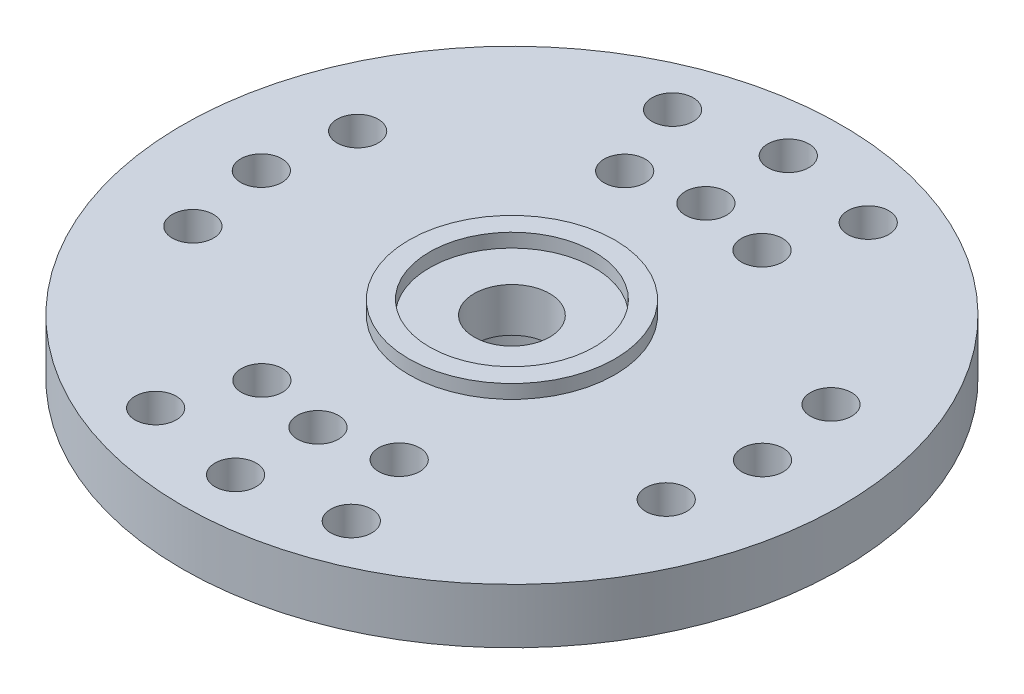
ISO-10303-21;
HEADER;
FILE_DESCRIPTION(('STEP AP214'),'2;1');
FILE_NAME('part.step','',(''),(''),'','','');
FILE_SCHEMA(('AUTOMOTIVE_DESIGN { 1 0 10303 214 1 1 1 1 }'));
ENDSEC;
DATA;
#1=APPLICATION_CONTEXT('core data for automotive mechanical design processes');
#2=APPLICATION_PROTOCOL_DEFINITION('international standard','automotive_design',2000,#1);
#3=PRODUCT_CONTEXT('',#1,'mechanical');
#4=PRODUCT('Part','Part','',(#3));
#5=PRODUCT_RELATED_PRODUCT_CATEGORY('part','',(#4));
#6=PRODUCT_DEFINITION_FORMATION('','',#4);
#7=PRODUCT_DEFINITION_CONTEXT('part definition',#1,'design');
#8=PRODUCT_DEFINITION('design','',#6,#7);
#9=PRODUCT_DEFINITION_SHAPE('','',#8);
#10=(LENGTH_UNIT() NAMED_UNIT(*) SI_UNIT(.MILLI.,.METRE.));
#11=(NAMED_UNIT(*) PLANE_ANGLE_UNIT() SI_UNIT($,.RADIAN.));
#12=(NAMED_UNIT(*) SI_UNIT($,.STERADIAN.) SOLID_ANGLE_UNIT());
#13=UNCERTAINTY_MEASURE_WITH_UNIT(LENGTH_MEASURE(1.E-05),#10,'distance_accuracy_value','');
#14=(GEOMETRIC_REPRESENTATION_CONTEXT(3) GLOBAL_UNCERTAINTY_ASSIGNED_CONTEXT((#13)) GLOBAL_UNIT_ASSIGNED_CONTEXT((#10,
#11,#12)) REPRESENTATION_CONTEXT('',''));
#15=CARTESIAN_POINT('',(0.,0.,0.));
#16=DIRECTION('',(0.,0.,1.));
#17=DIRECTION('',(1.,0.,0.));
#18=AXIS2_PLACEMENT_3D('',#15,#16,#17);
#19=CARTESIAN_POINT('',(0.,0.399999999999998,0.));
#20=DIRECTION('',(0.,1.,0.));
#21=DIRECTION('',(0.,0.,1.));
#22=AXIS2_PLACEMENT_3D('',#19,#20,#21);
#23=PLANE('',#22);
#24=CARTESIAN_POINT('',(0.,0.399999999999998,0.));
#25=DIRECTION('',(0.,1.,0.));
#26=DIRECTION('',(0.,0.,1.));
#27=AXIS2_PLACEMENT_3D('',#24,#25,#26);
#28=CIRCLE('',#27,1.375);
#29=CARTESIAN_POINT('',(0.,0.399999999999998,1.375));
#30=VERTEX_POINT('',#29);
#31=EDGE_CURVE('E25',#30,#30,#28,.T.);
#32=ORIENTED_EDGE('',*,*,#31,.T.);
#33=EDGE_LOOP('',(#32));
#34=FACE_BOUND('',#33,.T.);
#35=CARTESIAN_POINT('',(0.,0.399999999999998,0.));
#36=DIRECTION('',(0.,1.,0.));
#37=DIRECTION('',(0.,0.,1.));
#38=AXIS2_PLACEMENT_3D('',#35,#36,#37);
#39=CIRCLE('',#38,2.85);
#40=CARTESIAN_POINT('',(0.,0.399999999999998,2.85));
#41=VERTEX_POINT('',#40);
#42=EDGE_CURVE('E167',#41,#41,#39,.F.);
#43=ORIENTED_EDGE('',*,*,#42,.T.);
#44=EDGE_LOOP('',(#43));
#45=FACE_BOUND('',#44,.T.);
#46=ADVANCED_FACE('F22',(#34,#45),#23,.F.);
#47=CARTESIAN_POINT('',(0.,-2.6,0.));
#48=DIRECTION('',(0.,1.,0.));
#49=DIRECTION('',(0.,0.,1.));
#50=AXIS2_PLACEMENT_3D('',#47,#48,#49);
#51=CYLINDRICAL_SURFACE('',#50,1.375);
#52=CARTESIAN_POINT('',(0.,2.,0.));
#53=DIRECTION('',(0.,1.,0.));
#54=DIRECTION('',(0.,0.,1.));
#55=AXIS2_PLACEMENT_3D('',#52,#53,#54);
#56=CIRCLE('',#55,1.375);
#57=CARTESIAN_POINT('',(0.,2.,1.375));
#58=VERTEX_POINT('',#57);
#59=EDGE_CURVE('E165',#58,#58,#56,.F.);
#60=ORIENTED_EDGE('',*,*,#59,.F.);
#61=EDGE_LOOP('',(#60));
#62=FACE_BOUND('',#61,.T.);
#63=ORIENTED_EDGE('',*,*,#31,.F.);
#64=EDGE_LOOP('',(#63));
#65=FACE_BOUND('',#64,.T.);
#66=ADVANCED_FACE('F175',(#62,#65),#51,.F.);
#67=CARTESIAN_POINT('',(0.,-2.6,0.));
#68=DIRECTION('',(0.,1.,0.));
#69=DIRECTION('',(0.,0.,1.));
#70=AXIS2_PLACEMENT_3D('',#67,#68,#69);
#71=CYLINDRICAL_SURFACE('',#70,2.85);
#72=ORIENTED_EDGE('',*,*,#42,.F.);
#73=EDGE_LOOP('',(#72));
#74=FACE_BOUND('',#73,.T.);
#75=CARTESIAN_POINT('',(0.,-2.6,0.));
#76=DIRECTION('',(0.,1.,0.));
#77=DIRECTION('',(0.,0.,1.));
#78=AXIS2_PLACEMENT_3D('',#75,#76,#77);
#79=CIRCLE('',#78,2.85);
#80=CARTESIAN_POINT('',(0.,-2.6,2.85));
#81=VERTEX_POINT('',#80);
#82=EDGE_CURVE('E162',#81,#81,#79,.F.);
#83=ORIENTED_EDGE('',*,*,#82,.T.);
#84=EDGE_LOOP('',(#83));
#85=FACE_BOUND('',#84,.T.);
#86=ADVANCED_FACE('F177',(#74,#85),#71,.F.);
#87=CARTESIAN_POINT('',(0.,2.,0.));
#88=DIRECTION('',(0.,1.,0.));
#89=DIRECTION('',(0.,0.,1.));
#90=AXIS2_PLACEMENT_3D('',#87,#88,#89);
#91=PLANE('',#90);
#92=ORIENTED_EDGE('',*,*,#59,.T.);
#93=EDGE_LOOP('',(#92));
#94=FACE_BOUND('',#93,.T.);
#95=CARTESIAN_POINT('',(0.,2.,0.));
#96=DIRECTION('',(0.,1.,0.));
#97=DIRECTION('',(0.,0.,1.));
#98=AXIS2_PLACEMENT_3D('',#95,#96,#97);
#99=CIRCLE('',#98,3.);
#100=CARTESIAN_POINT('',(0.,2.,3.));
#101=VERTEX_POINT('',#100);
#102=EDGE_CURVE('E159',#101,#101,#99,.T.);
#103=ORIENTED_EDGE('',*,*,#102,.T.);
#104=EDGE_LOOP('',(#103));
#105=FACE_BOUND('',#104,.T.);
#106=ADVANCED_FACE('F184',(#94,#105),#91,.T.);
#107=CARTESIAN_POINT('',(0.,-2.6,0.));
#108=DIRECTION('',(0.,1.,0.));
#109=DIRECTION('',(0.,0.,1.));
#110=AXIS2_PLACEMENT_3D('',#107,#108,#109);
#111=PLANE('',#110);
#112=ORIENTED_EDGE('',*,*,#82,.F.);
#113=EDGE_LOOP('',(#112));
#114=FACE_BOUND('',#113,.T.);
#115=CARTESIAN_POINT('',(0.,-2.6,0.));
#116=DIRECTION('',(0.,1.,0.));
#117=DIRECTION('',(0.,0.,1.));
#118=AXIS2_PLACEMENT_3D('',#115,#116,#117);
#119=CIRCLE('',#118,4.45);
#120=CARTESIAN_POINT('',(0.,-2.6,4.45));
#121=VERTEX_POINT('',#120);
#122=EDGE_CURVE('E156',#121,#121,#119,.T.);
#123=ORIENTED_EDGE('',*,*,#122,.F.);
#124=EDGE_LOOP('',(#123));
#125=FACE_BOUND('',#124,.T.);
#126=ADVANCED_FACE('F291',(#114,#125),#111,.F.);
#127=CARTESIAN_POINT('',(0.,2.,0.));
#128=DIRECTION('',(0.,1.,0.));
#129=DIRECTION('',(0.,0.,1.));
#130=AXIS2_PLACEMENT_3D('',#127,#128,#129);
#131=CYLINDRICAL_SURFACE('',#130,3.);
#132=CARTESIAN_POINT('',(0.,2.5,0.));
#133=DIRECTION('',(0.,1.,0.));
#134=DIRECTION('',(0.,0.,1.));
#135=AXIS2_PLACEMENT_3D('',#132,#133,#134);
#136=CIRCLE('',#135,3.);
#137=CARTESIAN_POINT('',(0.,2.5,3.));
#138=VERTEX_POINT('',#137);
#139=EDGE_CURVE('E153',#138,#138,#136,.F.);
#140=ORIENTED_EDGE('',*,*,#139,.F.);
#141=EDGE_LOOP('',(#140));
#142=FACE_BOUND('',#141,.T.);
#143=ORIENTED_EDGE('',*,*,#102,.F.);
#144=EDGE_LOOP('',(#143));
#145=FACE_BOUND('',#144,.T.);
#146=ADVANCED_FACE('F287',(#142,#145),#131,.F.);
#147=CARTESIAN_POINT('',(0.,0.,0.));
#148=DIRECTION('',(0.,1.,0.));
#149=DIRECTION('',(0.,0.,1.));
#150=AXIS2_PLACEMENT_3D('',#147,#148,#149);
#151=CYLINDRICAL_SURFACE('',#150,4.45);
#152=CARTESIAN_POINT('',(0.,0.,0.));
#153=DIRECTION('',(0.,1.,0.));
#154=DIRECTION('',(0.,0.,1.));
#155=AXIS2_PLACEMENT_3D('',#152,#153,#154);
#156=CIRCLE('',#155,4.45);
#157=CARTESIAN_POINT('',(0.,0.,4.45));
#158=VERTEX_POINT('',#157);
#159=EDGE_CURVE('E150',#158,#158,#156,.F.);
#160=ORIENTED_EDGE('',*,*,#159,.T.);
#161=EDGE_LOOP('',(#160));
#162=FACE_BOUND('',#161,.T.);
#163=ORIENTED_EDGE('',*,*,#122,.T.);
#164=EDGE_LOOP('',(#163));
#165=FACE_BOUND('',#164,.T.);
#166=ADVANCED_FACE('F283',(#162,#165),#151,.T.);
#167=CARTESIAN_POINT('',(0.,2.5,0.));
#168=DIRECTION('',(0.,1.,0.));
#169=DIRECTION('',(0.,0.,1.));
#170=AXIS2_PLACEMENT_3D('',#167,#168,#169);
#171=PLANE('',#170);
#172=ORIENTED_EDGE('',*,*,#139,.T.);
#173=EDGE_LOOP('',(#172));
#174=FACE_BOUND('',#173,.T.);
#175=CARTESIAN_POINT('',(0.,2.5,0.));
#176=DIRECTION('',(0.,1.,0.));
#177=DIRECTION('',(0.,0.,1.));
#178=AXIS2_PLACEMENT_3D('',#175,#176,#177);
#179=CIRCLE('',#178,3.75);
#180=CARTESIAN_POINT('',(0.,2.5,3.75));
#181=VERTEX_POINT('',#180);
#182=EDGE_CURVE('E144',#181,#181,#179,.F.);
#183=ORIENTED_EDGE('',*,*,#182,.F.);
#184=EDGE_LOOP('',(#183));
#185=FACE_BOUND('',#184,.T.);
#186=ADVANCED_FACE('F279',(#174,#185),#171,.T.);
#187=CARTESIAN_POINT('',(0.,0.,0.));
#188=DIRECTION('',(0.,1.,0.));
#189=DIRECTION('',(0.,0.,1.));
#190=AXIS2_PLACEMENT_3D('',#187,#188,#189);
#191=PLANE('',#190);
#192=CARTESIAN_POINT('',(-3.56194690265486,0.,9.41097447200168));
#193=DIRECTION('',(0.,1.,0.));
#194=DIRECTION('',(0.,0.,1.));
#195=AXIS2_PLACEMENT_3D('',#192,#193,#194);
#196=CIRCLE('',#195,0.75);
#197=CARTESIAN_POINT('',(-3.56194690265486,0.,10.1609744720017));
#198=VERTEX_POINT('',#197);
#199=EDGE_CURVE('E90',#198,#198,#196,.T.);
#200=ORIENTED_EDGE('',*,*,#199,.T.);
#201=EDGE_LOOP('',(#200));
#202=FACE_BOUND('',#201,.T.);
#203=CARTESIAN_POINT('',(3.56194690265486,0.,9.41097447200168));
#204=DIRECTION('',(0.,1.,0.));
#205=DIRECTION('',(0.,0.,1.));
#206=AXIS2_PLACEMENT_3D('',#203,#204,#205);
#207=CIRCLE('',#206,0.75);
#208=CARTESIAN_POINT('',(3.56194690265486,0.,10.1609744720017));
#209=VERTEX_POINT('',#208);
#210=EDGE_CURVE('E93',#209,#209,#207,.T.);
#211=ORIENTED_EDGE('',*,*,#210,.T.);
#212=EDGE_LOOP('',(#211));
#213=FACE_BOUND('',#212,.T.);
#214=CARTESIAN_POINT('',(-3.56194690265486,0.,-9.41097447200168));
#215=DIRECTION('',(0.,1.,0.));
#216=DIRECTION('',(0.,0.,1.));
#217=AXIS2_PLACEMENT_3D('',#214,#215,#216);
#218=CIRCLE('',#217,0.75);
#219=CARTESIAN_POINT('',(-3.56194690265486,0.,-8.66097447200168));
#220=VERTEX_POINT('',#219);
#221=EDGE_CURVE('E96',#220,#220,#218,.T.);
#222=ORIENTED_EDGE('',*,*,#221,.T.);
#223=EDGE_LOOP('',(#222));
#224=FACE_BOUND('',#223,.T.);
#225=CARTESIAN_POINT('',(3.56194690265486,0.,-9.41097447200168));
#226=DIRECTION('',(0.,1.,0.));
#227=DIRECTION('',(0.,0.,1.));
#228=AXIS2_PLACEMENT_3D('',#225,#226,#227);
#229=CIRCLE('',#228,0.75);
#230=CARTESIAN_POINT('',(3.56194690265486,0.,-8.66097447200168));
#231=VERTEX_POINT('',#230);
#232=EDGE_CURVE('E99',#231,#231,#229,.T.);
#233=ORIENTED_EDGE('',*,*,#232,.T.);
#234=EDGE_LOOP('',(#233));
#235=FACE_BOUND('',#234,.T.);
#236=CARTESIAN_POINT('',(0.,0.,10.0625));
#237=DIRECTION('',(0.,1.,0.));
#238=DIRECTION('',(0.,0.,1.));
#239=AXIS2_PLACEMENT_3D('',#236,#237,#238);
#240=CIRCLE('',#239,0.75);
#241=CARTESIAN_POINT('',(0.,0.,10.8125));
#242=VERTEX_POINT('',#241);
#243=EDGE_CURVE('E102',#242,#242,#240,.T.);
#244=ORIENTED_EDGE('',*,*,#243,.T.);
#245=EDGE_LOOP('',(#244));
#246=FACE_BOUND('',#245,.T.);
#247=CARTESIAN_POINT('',(0.,0.,-10.0625));
#248=DIRECTION('',(0.,1.,0.));
#249=DIRECTION('',(0.,0.,1.));
#250=AXIS2_PLACEMENT_3D('',#247,#248,#249);
#251=CIRCLE('',#250,0.75);
#252=CARTESIAN_POINT('',(0.,0.,-9.3125));
#253=VERTEX_POINT('',#252);
#254=EDGE_CURVE('E105',#253,#253,#251,.T.);
#255=ORIENTED_EDGE('',*,*,#254,.T.);
#256=EDGE_LOOP('',(#255));
#257=FACE_BOUND('',#256,.T.);
#258=CARTESIAN_POINT('',(-2.5,0.,6.60521810767821));
#259=DIRECTION('',(0.,1.,0.));
#260=DIRECTION('',(0.,0.,1.));
#261=AXIS2_PLACEMENT_3D('',#258,#259,#260);
#262=CIRCLE('',#261,0.75);
#263=CARTESIAN_POINT('',(-2.5,0.,7.35521810767821));
#264=VERTEX_POINT('',#263);
#265=EDGE_CURVE('E108',#264,#264,#262,.T.);
#266=ORIENTED_EDGE('',*,*,#265,.T.);
#267=EDGE_LOOP('',(#266));
#268=FACE_BOUND('',#267,.T.);
#269=CARTESIAN_POINT('',(2.5,0.,6.60521810767821));
#270=DIRECTION('',(0.,1.,0.));
#271=DIRECTION('',(0.,0.,1.));
#272=AXIS2_PLACEMENT_3D('',#269,#270,#271);
#273=CIRCLE('',#272,0.75);
#274=CARTESIAN_POINT('',(2.5,0.,7.35521810767821));
#275=VERTEX_POINT('',#274);
#276=EDGE_CURVE('E111',#275,#275,#273,.T.);
#277=ORIENTED_EDGE('',*,*,#276,.T.);
#278=EDGE_LOOP('',(#277));
#279=FACE_BOUND('',#278,.T.);
#280=CARTESIAN_POINT('',(-2.5,0.,-6.60521810767821));
#281=DIRECTION('',(0.,1.,0.));
#282=DIRECTION('',(0.,0.,1.));
#283=AXIS2_PLACEMENT_3D('',#280,#281,#282);
#284=CIRCLE('',#283,0.75);
#285=CARTESIAN_POINT('',(-2.5,0.,-5.85521810767821));
#286=VERTEX_POINT('',#285);
#287=EDGE_CURVE('E114',#286,#286,#284,.T.);
#288=ORIENTED_EDGE('',*,*,#287,.T.);
#289=EDGE_LOOP('',(#288));
#290=FACE_BOUND('',#289,.T.);
#291=CARTESIAN_POINT('',(2.5,0.,-6.60521810767821));
#292=DIRECTION('',(0.,1.,0.));
#293=DIRECTION('',(0.,0.,1.));
#294=AXIS2_PLACEMENT_3D('',#291,#292,#293);
#295=CIRCLE('',#294,0.75);
#296=CARTESIAN_POINT('',(2.5,0.,-5.85521810767821));
#297=VERTEX_POINT('',#296);
#298=EDGE_CURVE('E117',#297,#297,#295,.T.);
#299=ORIENTED_EDGE('',*,*,#298,.T.);
#300=EDGE_LOOP('',(#299));
#301=FACE_BOUND('',#300,.T.);
#302=CARTESIAN_POINT('',(0.,0.,7.0625));
#303=DIRECTION('',(0.,1.,0.));
#304=DIRECTION('',(0.,0.,1.));
#305=AXIS2_PLACEMENT_3D('',#302,#303,#304);
#306=CIRCLE('',#305,0.75);
#307=CARTESIAN_POINT('',(0.,0.,7.8125));
#308=VERTEX_POINT('',#307);
#309=EDGE_CURVE('E120',#308,#308,#306,.T.);
#310=ORIENTED_EDGE('',*,*,#309,.T.);
#311=EDGE_LOOP('',(#310));
#312=FACE_BOUND('',#311,.T.);
#313=CARTESIAN_POINT('',(0.,0.,-7.0625));
#314=DIRECTION('',(0.,1.,0.));
#315=DIRECTION('',(0.,0.,1.));
#316=AXIS2_PLACEMENT_3D('',#313,#314,#315);
#317=CIRCLE('',#316,0.75);
#318=CARTESIAN_POINT('',(0.,0.,-6.3125));
#319=VERTEX_POINT('',#318);
#320=EDGE_CURVE('E123',#319,#319,#317,.T.);
#321=ORIENTED_EDGE('',*,*,#320,.T.);
#322=EDGE_LOOP('',(#321));
#323=FACE_BOUND('',#322,.T.);
#324=CARTESIAN_POINT('',(-8.61775057657159,0.,-3.));
#325=DIRECTION('',(0.,1.,0.));
#326=DIRECTION('',(0.,0.,1.));
#327=AXIS2_PLACEMENT_3D('',#324,#325,#326);
#328=CIRCLE('',#327,0.75);
#329=CARTESIAN_POINT('',(-8.61775057657159,0.,-2.25));
#330=VERTEX_POINT('',#329);
#331=EDGE_CURVE('E126',#330,#330,#328,.T.);
#332=ORIENTED_EDGE('',*,*,#331,.T.);
#333=EDGE_LOOP('',(#332));
#334=FACE_BOUND('',#333,.T.);
#335=CARTESIAN_POINT('',(-8.61775057657159,0.,3.));
#336=DIRECTION('',(0.,1.,0.));
#337=DIRECTION('',(0.,0.,1.));
#338=AXIS2_PLACEMENT_3D('',#335,#336,#337);
#339=CIRCLE('',#338,0.75);
#340=CARTESIAN_POINT('',(-8.61775057657159,0.,3.75));
#341=VERTEX_POINT('',#340);
#342=EDGE_CURVE('E129',#341,#341,#339,.T.);
#343=ORIENTED_EDGE('',*,*,#342,.T.);
#344=EDGE_LOOP('',(#343));
#345=FACE_BOUND('',#344,.T.);
#346=CARTESIAN_POINT('',(8.61775057657159,0.,-3.));
#347=DIRECTION('',(0.,1.,0.));
#348=DIRECTION('',(0.,0.,1.));
#349=AXIS2_PLACEMENT_3D('',#346,#347,#348);
#350=CIRCLE('',#349,0.75);
#351=CARTESIAN_POINT('',(8.61775057657159,0.,-2.25));
#352=VERTEX_POINT('',#351);
#353=EDGE_CURVE('E132',#352,#352,#350,.T.);
#354=ORIENTED_EDGE('',*,*,#353,.T.);
#355=EDGE_LOOP('',(#354));
#356=FACE_BOUND('',#355,.T.);
#357=CARTESIAN_POINT('',(8.61775057657159,0.,3.));
#358=DIRECTION('',(0.,1.,0.));
#359=DIRECTION('',(0.,0.,1.));
#360=AXIS2_PLACEMENT_3D('',#357,#358,#359);
#361=CIRCLE('',#360,0.75);
#362=CARTESIAN_POINT('',(8.61775057657159,0.,3.75));
#363=VERTEX_POINT('',#362);
#364=EDGE_CURVE('E135',#363,#363,#361,.T.);
#365=ORIENTED_EDGE('',*,*,#364,.T.);
#366=EDGE_LOOP('',(#365));
#367=FACE_BOUND('',#366,.T.);
#368=CARTESIAN_POINT('',(-9.125,0.,0.));
#369=DIRECTION('',(0.,1.,0.));
#370=DIRECTION('',(0.,0.,1.));
#371=AXIS2_PLACEMENT_3D('',#368,#369,#370);
#372=CIRCLE('',#371,0.75);
#373=CARTESIAN_POINT('',(-9.125,0.,0.75));
#374=VERTEX_POINT('',#373);
#375=EDGE_CURVE('E138',#374,#374,#372,.T.);
#376=ORIENTED_EDGE('',*,*,#375,.T.);
#377=EDGE_LOOP('',(#376));
#378=FACE_BOUND('',#377,.T.);
#379=CARTESIAN_POINT('',(9.125,0.,0.));
#380=DIRECTION('',(0.,1.,0.));
#381=DIRECTION('',(0.,0.,1.));
#382=AXIS2_PLACEMENT_3D('',#379,#380,#381);
#383=CIRCLE('',#382,0.75);
#384=CARTESIAN_POINT('',(9.125,0.,0.75));
#385=VERTEX_POINT('',#384);
#386=EDGE_CURVE('E141',#385,#385,#383,.T.);
#387=ORIENTED_EDGE('',*,*,#386,.T.);
#388=EDGE_LOOP('',(#387));
#389=FACE_BOUND('',#388,.T.);
#390=ORIENTED_EDGE('',*,*,#159,.F.);
#391=EDGE_LOOP('',(#390));
#392=FACE_BOUND('',#391,.T.);
#393=CARTESIAN_POINT('',(0.,0.,0.));
#394=DIRECTION('',(0.,1.,0.));
#395=DIRECTION('',(0.,0.,1.));
#396=AXIS2_PLACEMENT_3D('',#393,#394,#395);
#397=CIRCLE('',#396,12.);
#398=CARTESIAN_POINT('',(0.,0.,12.));
#399=VERTEX_POINT('',#398);
#400=EDGE_CURVE('E147',#399,#399,#397,.T.);
#401=ORIENTED_EDGE('',*,*,#400,.F.);
#402=EDGE_LOOP('',(#401));
#403=FACE_BOUND('',#402,.T.);
#404=ADVANCED_FACE('F275',(#202,#213,#224,#235,#246,#257,#268,#279,#290,#301,#312,#323,#334,
#345,#356,#367,#378,#389,#392,#403),#191,.F.);
#405=CARTESIAN_POINT('',(0.,0.,0.));
#406=DIRECTION('',(0.,1.,0.));
#407=DIRECTION('',(0.,0.,1.));
#408=AXIS2_PLACEMENT_3D('',#405,#406,#407);
#409=CYLINDRICAL_SURFACE('',#408,12.);
#410=CARTESIAN_POINT('',(0.,2.,0.));
#411=DIRECTION('',(0.,1.,0.));
#412=DIRECTION('',(0.,0.,1.));
#413=AXIS2_PLACEMENT_3D('',#410,#411,#412);
#414=CIRCLE('',#413,12.);
#415=CARTESIAN_POINT('',(0.,2.,12.));
#416=VERTEX_POINT('',#415);
#417=EDGE_CURVE('E87',#416,#416,#414,.T.);
#418=ORIENTED_EDGE('',*,*,#417,.F.);
#419=EDGE_LOOP('',(#418));
#420=FACE_BOUND('',#419,.T.);
#421=ORIENTED_EDGE('',*,*,#400,.T.);
#422=EDGE_LOOP('',(#421));
#423=FACE_BOUND('',#422,.T.);
#424=ADVANCED_FACE('F271',(#420,#423),#409,.T.);
#425=CARTESIAN_POINT('',(0.,2.,0.));
#426=DIRECTION('',(0.,1.,0.));
#427=DIRECTION('',(0.,0.,1.));
#428=AXIS2_PLACEMENT_3D('',#425,#426,#427);
#429=CYLINDRICAL_SURFACE('',#428,3.75);
#430=ORIENTED_EDGE('',*,*,#182,.T.);
#431=EDGE_LOOP('',(#430));
#432=FACE_BOUND('',#431,.T.);
#433=CARTESIAN_POINT('',(0.,2.,0.));
#434=DIRECTION('',(0.,1.,0.));
#435=DIRECTION('',(0.,0.,1.));
#436=AXIS2_PLACEMENT_3D('',#433,#434,#435);
#437=CIRCLE('',#436,3.75);
#438=CARTESIAN_POINT('',(0.,2.,3.75));
#439=VERTEX_POINT('',#438);
#440=EDGE_CURVE('E84',#439,#439,#437,.F.);
#441=ORIENTED_EDGE('',*,*,#440,.F.);
#442=EDGE_LOOP('',(#441));
#443=FACE_BOUND('',#442,.T.);
#444=ADVANCED_FACE('F267',(#432,#443),#429,.T.);
#445=CARTESIAN_POINT('',(9.125,2.,0.));
#446=DIRECTION('',(0.,1.,0.));
#447=DIRECTION('',(0.,0.,1.));
#448=AXIS2_PLACEMENT_3D('',#445,#446,#447);
#449=CYLINDRICAL_SURFACE('',#448,0.75);
#450=CARTESIAN_POINT('',(9.125,2.,0.));
#451=DIRECTION('',(0.,1.,0.));
#452=DIRECTION('',(0.,0.,1.));
#453=AXIS2_PLACEMENT_3D('',#450,#451,#452);
#454=CIRCLE('',#453,0.75);
#455=CARTESIAN_POINT('',(9.125,2.,0.75));
#456=VERTEX_POINT('',#455);
#457=EDGE_CURVE('E81',#456,#456,#454,.F.);
#458=ORIENTED_EDGE('',*,*,#457,.F.);
#459=EDGE_LOOP('',(#458));
#460=FACE_BOUND('',#459,.T.);
#461=ORIENTED_EDGE('',*,*,#386,.F.);
#462=EDGE_LOOP('',(#461));
#463=FACE_BOUND('',#462,.T.);
#464=ADVANCED_FACE('F263',(#460,#463),#449,.F.);
#465=CARTESIAN_POINT('',(-9.125,2.,0.));
#466=DIRECTION('',(0.,1.,0.));
#467=DIRECTION('',(0.,0.,1.));
#468=AXIS2_PLACEMENT_3D('',#465,#466,#467);
#469=CYLINDRICAL_SURFACE('',#468,0.75);
#470=CARTESIAN_POINT('',(-9.125,2.,0.));
#471=DIRECTION('',(0.,1.,0.));
#472=DIRECTION('',(0.,0.,1.));
#473=AXIS2_PLACEMENT_3D('',#470,#471,#472);
#474=CIRCLE('',#473,0.75);
#475=CARTESIAN_POINT('',(-9.125,2.,0.75));
#476=VERTEX_POINT('',#475);
#477=EDGE_CURVE('E78',#476,#476,#474,.F.);
#478=ORIENTED_EDGE('',*,*,#477,.F.);
#479=EDGE_LOOP('',(#478));
#480=FACE_BOUND('',#479,.T.);
#481=ORIENTED_EDGE('',*,*,#375,.F.);
#482=EDGE_LOOP('',(#481));
#483=FACE_BOUND('',#482,.T.);
#484=ADVANCED_FACE('F259',(#480,#483),#469,.F.);
#485=CARTESIAN_POINT('',(8.61775057657159,2.,3.));
#486=DIRECTION('',(0.,1.,0.));
#487=DIRECTION('',(0.,0.,1.));
#488=AXIS2_PLACEMENT_3D('',#485,#486,#487);
#489=CYLINDRICAL_SURFACE('',#488,0.75);
#490=CARTESIAN_POINT('',(8.61775057657159,2.,3.));
#491=DIRECTION('',(0.,1.,0.));
#492=DIRECTION('',(0.,0.,1.));
#493=AXIS2_PLACEMENT_3D('',#490,#491,#492);
#494=CIRCLE('',#493,0.75);
#495=CARTESIAN_POINT('',(8.61775057657159,2.,3.75));
#496=VERTEX_POINT('',#495);
#497=EDGE_CURVE('E75',#496,#496,#494,.F.);
#498=ORIENTED_EDGE('',*,*,#497,.F.);
#499=EDGE_LOOP('',(#498));
#500=FACE_BOUND('',#499,.T.);
#501=ORIENTED_EDGE('',*,*,#364,.F.);
#502=EDGE_LOOP('',(#501));
#503=FACE_BOUND('',#502,.T.);
#504=ADVANCED_FACE('F255',(#500,#503),#489,.F.);
#505=CARTESIAN_POINT('',(8.61775057657159,2.,-3.));
#506=DIRECTION('',(0.,1.,0.));
#507=DIRECTION('',(0.,0.,1.));
#508=AXIS2_PLACEMENT_3D('',#505,#506,#507);
#509=CYLINDRICAL_SURFACE('',#508,0.75);
#510=CARTESIAN_POINT('',(8.61775057657159,2.,-3.));
#511=DIRECTION('',(0.,1.,0.));
#512=DIRECTION('',(0.,0.,1.));
#513=AXIS2_PLACEMENT_3D('',#510,#511,#512);
#514=CIRCLE('',#513,0.75);
#515=CARTESIAN_POINT('',(8.61775057657159,2.,-2.25));
#516=VERTEX_POINT('',#515);
#517=EDGE_CURVE('E72',#516,#516,#514,.F.);
#518=ORIENTED_EDGE('',*,*,#517,.F.);
#519=EDGE_LOOP('',(#518));
#520=FACE_BOUND('',#519,.T.);
#521=ORIENTED_EDGE('',*,*,#353,.F.);
#522=EDGE_LOOP('',(#521));
#523=FACE_BOUND('',#522,.T.);
#524=ADVANCED_FACE('F251',(#520,#523),#509,.F.);
#525=CARTESIAN_POINT('',(-8.61775057657159,2.,3.));
#526=DIRECTION('',(0.,1.,0.));
#527=DIRECTION('',(0.,0.,1.));
#528=AXIS2_PLACEMENT_3D('',#525,#526,#527);
#529=CYLINDRICAL_SURFACE('',#528,0.75);
#530=CARTESIAN_POINT('',(-8.61775057657159,2.,3.));
#531=DIRECTION('',(0.,1.,0.));
#532=DIRECTION('',(0.,0.,1.));
#533=AXIS2_PLACEMENT_3D('',#530,#531,#532);
#534=CIRCLE('',#533,0.75);
#535=CARTESIAN_POINT('',(-8.61775057657159,2.,3.75));
#536=VERTEX_POINT('',#535);
#537=EDGE_CURVE('E69',#536,#536,#534,.F.);
#538=ORIENTED_EDGE('',*,*,#537,.F.);
#539=EDGE_LOOP('',(#538));
#540=FACE_BOUND('',#539,.T.);
#541=ORIENTED_EDGE('',*,*,#342,.F.);
#542=EDGE_LOOP('',(#541));
#543=FACE_BOUND('',#542,.T.);
#544=ADVANCED_FACE('F247',(#540,#543),#529,.F.);
#545=CARTESIAN_POINT('',(-8.61775057657159,2.,-3.));
#546=DIRECTION('',(0.,1.,0.));
#547=DIRECTION('',(0.,0.,1.));
#548=AXIS2_PLACEMENT_3D('',#545,#546,#547);
#549=CYLINDRICAL_SURFACE('',#548,0.75);
#550=CARTESIAN_POINT('',(-8.61775057657159,2.,-3.));
#551=DIRECTION('',(0.,1.,0.));
#552=DIRECTION('',(0.,0.,1.));
#553=AXIS2_PLACEMENT_3D('',#550,#551,#552);
#554=CIRCLE('',#553,0.75);
#555=CARTESIAN_POINT('',(-8.61775057657159,2.,-2.25));
#556=VERTEX_POINT('',#555);
#557=EDGE_CURVE('E66',#556,#556,#554,.F.);
#558=ORIENTED_EDGE('',*,*,#557,.F.);
#559=EDGE_LOOP('',(#558));
#560=FACE_BOUND('',#559,.T.);
#561=ORIENTED_EDGE('',*,*,#331,.F.);
#562=EDGE_LOOP('',(#561));
#563=FACE_BOUND('',#562,.T.);
#564=ADVANCED_FACE('F243',(#560,#563),#549,.F.);
#565=CARTESIAN_POINT('',(0.,2.,-7.0625));
#566=DIRECTION('',(0.,1.,0.));
#567=DIRECTION('',(0.,0.,1.));
#568=AXIS2_PLACEMENT_3D('',#565,#566,#567);
#569=CYLINDRICAL_SURFACE('',#568,0.75);
#570=CARTESIAN_POINT('',(0.,2.,-7.0625));
#571=DIRECTION('',(0.,1.,0.));
#572=DIRECTION('',(0.,0.,1.));
#573=AXIS2_PLACEMENT_3D('',#570,#571,#572);
#574=CIRCLE('',#573,0.75);
#575=CARTESIAN_POINT('',(0.,2.,-6.3125));
#576=VERTEX_POINT('',#575);
#577=EDGE_CURVE('E63',#576,#576,#574,.F.);
#578=ORIENTED_EDGE('',*,*,#577,.F.);
#579=EDGE_LOOP('',(#578));
#580=FACE_BOUND('',#579,.T.);
#581=ORIENTED_EDGE('',*,*,#320,.F.);
#582=EDGE_LOOP('',(#581));
#583=FACE_BOUND('',#582,.T.);
#584=ADVANCED_FACE('F239',(#580,#583),#569,.F.);
#585=CARTESIAN_POINT('',(0.,2.,7.0625));
#586=DIRECTION('',(0.,1.,0.));
#587=DIRECTION('',(0.,0.,1.));
#588=AXIS2_PLACEMENT_3D('',#585,#586,#587);
#589=CYLINDRICAL_SURFACE('',#588,0.75);
#590=CARTESIAN_POINT('',(0.,2.,7.0625));
#591=DIRECTION('',(0.,1.,0.));
#592=DIRECTION('',(0.,0.,1.));
#593=AXIS2_PLACEMENT_3D('',#590,#591,#592);
#594=CIRCLE('',#593,0.75);
#595=CARTESIAN_POINT('',(0.,2.,7.8125));
#596=VERTEX_POINT('',#595);
#597=EDGE_CURVE('E60',#596,#596,#594,.F.);
#598=ORIENTED_EDGE('',*,*,#597,.F.);
#599=EDGE_LOOP('',(#598));
#600=FACE_BOUND('',#599,.T.);
#601=ORIENTED_EDGE('',*,*,#309,.F.);
#602=EDGE_LOOP('',(#601));
#603=FACE_BOUND('',#602,.T.);
#604=ADVANCED_FACE('F235',(#600,#603),#589,.F.);
#605=CARTESIAN_POINT('',(2.49999999999998,2.,-6.60521810767821));
#606=DIRECTION('',(0.,1.,0.));
#607=DIRECTION('',(0.,0.,1.));
#608=AXIS2_PLACEMENT_3D('',#605,#606,#607);
#609=CYLINDRICAL_SURFACE('',#608,0.75);
#610=CARTESIAN_POINT('',(2.49999999999998,2.,-6.60521810767821));
#611=DIRECTION('',(0.,1.,0.));
#612=DIRECTION('',(0.,0.,1.));
#613=AXIS2_PLACEMENT_3D('',#610,#611,#612);
#614=CIRCLE('',#613,0.75);
#615=CARTESIAN_POINT('',(2.49999999999998,2.,-5.85521810767821));
#616=VERTEX_POINT('',#615);
#617=EDGE_CURVE('E57',#616,#616,#614,.F.);
#618=ORIENTED_EDGE('',*,*,#617,.F.);
#619=EDGE_LOOP('',(#618));
#620=FACE_BOUND('',#619,.T.);
#621=ORIENTED_EDGE('',*,*,#298,.F.);
#622=EDGE_LOOP('',(#621));
#623=FACE_BOUND('',#622,.T.);
#624=ADVANCED_FACE('F231',(#620,#623),#609,.F.);
#625=CARTESIAN_POINT('',(-2.5,2.,-6.60521810767821));
#626=DIRECTION('',(0.,1.,0.));
#627=DIRECTION('',(0.,0.,1.));
#628=AXIS2_PLACEMENT_3D('',#625,#626,#627);
#629=CYLINDRICAL_SURFACE('',#628,0.75);
#630=CARTESIAN_POINT('',(-2.5,2.,-6.60521810767821));
#631=DIRECTION('',(0.,1.,0.));
#632=DIRECTION('',(0.,0.,1.));
#633=AXIS2_PLACEMENT_3D('',#630,#631,#632);
#634=CIRCLE('',#633,0.75);
#635=CARTESIAN_POINT('',(-2.5,2.,-5.85521810767821));
#636=VERTEX_POINT('',#635);
#637=EDGE_CURVE('E54',#636,#636,#634,.F.);
#638=ORIENTED_EDGE('',*,*,#637,.F.);
#639=EDGE_LOOP('',(#638));
#640=FACE_BOUND('',#639,.T.);
#641=ORIENTED_EDGE('',*,*,#287,.F.);
#642=EDGE_LOOP('',(#641));
#643=FACE_BOUND('',#642,.T.);
#644=ADVANCED_FACE('F227',(#640,#643),#629,.F.);
#645=CARTESIAN_POINT('',(2.49999999999998,2.,6.60521810767821));
#646=DIRECTION('',(0.,1.,0.));
#647=DIRECTION('',(0.,0.,1.));
#648=AXIS2_PLACEMENT_3D('',#645,#646,#647);
#649=CYLINDRICAL_SURFACE('',#648,0.75);
#650=CARTESIAN_POINT('',(2.49999999999998,2.,6.60521810767821));
#651=DIRECTION('',(0.,1.,0.));
#652=DIRECTION('',(0.,0.,1.));
#653=AXIS2_PLACEMENT_3D('',#650,#651,#652);
#654=CIRCLE('',#653,0.75);
#655=CARTESIAN_POINT('',(2.49999999999998,2.,7.35521810767821));
#656=VERTEX_POINT('',#655);
#657=EDGE_CURVE('E51',#656,#656,#654,.F.);
#658=ORIENTED_EDGE('',*,*,#657,.F.);
#659=EDGE_LOOP('',(#658));
#660=FACE_BOUND('',#659,.T.);
#661=ORIENTED_EDGE('',*,*,#276,.F.);
#662=EDGE_LOOP('',(#661));
#663=FACE_BOUND('',#662,.T.);
#664=ADVANCED_FACE('F223',(#660,#663),#649,.F.);
#665=CARTESIAN_POINT('',(-2.5,2.,6.60521810767821));
#666=DIRECTION('',(0.,1.,0.));
#667=DIRECTION('',(0.,0.,1.));
#668=AXIS2_PLACEMENT_3D('',#665,#666,#667);
#669=CYLINDRICAL_SURFACE('',#668,0.75);
#670=CARTESIAN_POINT('',(-2.5,2.,6.60521810767821));
#671=DIRECTION('',(0.,1.,0.));
#672=DIRECTION('',(0.,0.,1.));
#673=AXIS2_PLACEMENT_3D('',#670,#671,#672);
#674=CIRCLE('',#673,0.75);
#675=CARTESIAN_POINT('',(-2.5,2.,7.35521810767821));
#676=VERTEX_POINT('',#675);
#677=EDGE_CURVE('E48',#676,#676,#674,.F.);
#678=ORIENTED_EDGE('',*,*,#677,.F.);
#679=EDGE_LOOP('',(#678));
#680=FACE_BOUND('',#679,.T.);
#681=ORIENTED_EDGE('',*,*,#265,.F.);
#682=EDGE_LOOP('',(#681));
#683=FACE_BOUND('',#682,.T.);
#684=ADVANCED_FACE('F219',(#680,#683),#669,.F.);
#685=CARTESIAN_POINT('',(0.,2.,-10.0625));
#686=DIRECTION('',(0.,1.,0.));
#687=DIRECTION('',(0.,0.,1.));
#688=AXIS2_PLACEMENT_3D('',#685,#686,#687);
#689=CYLINDRICAL_SURFACE('',#688,0.75);
#690=CARTESIAN_POINT('',(0.,2.,-10.0625));
#691=DIRECTION('',(0.,1.,0.));
#692=DIRECTION('',(0.,0.,1.));
#693=AXIS2_PLACEMENT_3D('',#690,#691,#692);
#694=CIRCLE('',#693,0.75);
#695=CARTESIAN_POINT('',(0.,2.,-9.3125));
#696=VERTEX_POINT('',#695);
#697=EDGE_CURVE('E45',#696,#696,#694,.F.);
#698=ORIENTED_EDGE('',*,*,#697,.F.);
#699=EDGE_LOOP('',(#698));
#700=FACE_BOUND('',#699,.T.);
#701=ORIENTED_EDGE('',*,*,#254,.F.);
#702=EDGE_LOOP('',(#701));
#703=FACE_BOUND('',#702,.T.);
#704=ADVANCED_FACE('F215',(#700,#703),#689,.F.);
#705=CARTESIAN_POINT('',(0.,2.,10.0625));
#706=DIRECTION('',(0.,1.,0.));
#707=DIRECTION('',(0.,0.,1.));
#708=AXIS2_PLACEMENT_3D('',#705,#706,#707);
#709=CYLINDRICAL_SURFACE('',#708,0.75);
#710=CARTESIAN_POINT('',(0.,2.,10.0625));
#711=DIRECTION('',(0.,1.,0.));
#712=DIRECTION('',(0.,0.,1.));
#713=AXIS2_PLACEMENT_3D('',#710,#711,#712);
#714=CIRCLE('',#713,0.75);
#715=CARTESIAN_POINT('',(0.,2.,10.8125));
#716=VERTEX_POINT('',#715);
#717=EDGE_CURVE('E42',#716,#716,#714,.F.);
#718=ORIENTED_EDGE('',*,*,#717,.F.);
#719=EDGE_LOOP('',(#718));
#720=FACE_BOUND('',#719,.T.);
#721=ORIENTED_EDGE('',*,*,#243,.F.);
#722=EDGE_LOOP('',(#721));
#723=FACE_BOUND('',#722,.T.);
#724=ADVANCED_FACE('F211',(#720,#723),#709,.F.);
#725=CARTESIAN_POINT('',(3.56194690265484,2.,-9.41097447200168));
#726=DIRECTION('',(0.,1.,0.));
#727=DIRECTION('',(0.,0.,1.));
#728=AXIS2_PLACEMENT_3D('',#725,#726,#727);
#729=CYLINDRICAL_SURFACE('',#728,0.75);
#730=CARTESIAN_POINT('',(3.56194690265484,2.,-9.41097447200168));
#731=DIRECTION('',(0.,1.,0.));
#732=DIRECTION('',(0.,0.,1.));
#733=AXIS2_PLACEMENT_3D('',#730,#731,#732);
#734=CIRCLE('',#733,0.75);
#735=CARTESIAN_POINT('',(3.56194690265484,2.,-8.66097447200168));
#736=VERTEX_POINT('',#735);
#737=EDGE_CURVE('E39',#736,#736,#734,.F.);
#738=ORIENTED_EDGE('',*,*,#737,.F.);
#739=EDGE_LOOP('',(#738));
#740=FACE_BOUND('',#739,.T.);
#741=ORIENTED_EDGE('',*,*,#232,.F.);
#742=EDGE_LOOP('',(#741));
#743=FACE_BOUND('',#742,.T.);
#744=ADVANCED_FACE('F207',(#740,#743),#729,.F.);
#745=CARTESIAN_POINT('',(-3.56194690265486,2.,-9.41097447200168));
#746=DIRECTION('',(0.,1.,0.));
#747=DIRECTION('',(0.,0.,1.));
#748=AXIS2_PLACEMENT_3D('',#745,#746,#747);
#749=CYLINDRICAL_SURFACE('',#748,0.75);
#750=CARTESIAN_POINT('',(-3.56194690265486,2.,-9.41097447200168));
#751=DIRECTION('',(0.,1.,0.));
#752=DIRECTION('',(0.,0.,1.));
#753=AXIS2_PLACEMENT_3D('',#750,#751,#752);
#754=CIRCLE('',#753,0.75);
#755=CARTESIAN_POINT('',(-3.56194690265486,2.,-8.66097447200168));
#756=VERTEX_POINT('',#755);
#757=EDGE_CURVE('E34',#756,#756,#754,.F.);
#758=ORIENTED_EDGE('',*,*,#757,.F.);
#759=EDGE_LOOP('',(#758));
#760=FACE_BOUND('',#759,.T.);
#761=ORIENTED_EDGE('',*,*,#221,.F.);
#762=EDGE_LOOP('',(#761));
#763=FACE_BOUND('',#762,.T.);
#764=ADVANCED_FACE('F203',(#760,#763),#749,.F.);
#765=CARTESIAN_POINT('',(3.56194690265484,2.,9.41097447200168));
#766=DIRECTION('',(0.,1.,0.));
#767=DIRECTION('',(0.,0.,1.));
#768=AXIS2_PLACEMENT_3D('',#765,#766,#767);
#769=CYLINDRICAL_SURFACE('',#768,0.75);
#770=CARTESIAN_POINT('',(3.56194690265484,2.,9.41097447200168));
#771=DIRECTION('',(0.,1.,0.));
#772=DIRECTION('',(0.,0.,1.));
#773=AXIS2_PLACEMENT_3D('',#770,#771,#772);
#774=CIRCLE('',#773,0.75);
#775=CARTESIAN_POINT('',(3.56194690265484,2.,10.1609744720017));
#776=VERTEX_POINT('',#775);
#777=EDGE_CURVE('E29',#776,#776,#774,.F.);
#778=ORIENTED_EDGE('',*,*,#777,.F.);
#779=EDGE_LOOP('',(#778));
#780=FACE_BOUND('',#779,.T.);
#781=ORIENTED_EDGE('',*,*,#210,.F.);
#782=EDGE_LOOP('',(#781));
#783=FACE_BOUND('',#782,.T.);
#784=ADVANCED_FACE('F196',(#780,#783),#769,.F.);
#785=CARTESIAN_POINT('',(-3.56194690265486,2.,9.41097447200168));
#786=DIRECTION('',(0.,1.,0.));
#787=DIRECTION('',(0.,0.,1.));
#788=AXIS2_PLACEMENT_3D('',#785,#786,#787);
#789=CYLINDRICAL_SURFACE('',#788,0.75);
#790=CARTESIAN_POINT('',(-3.56194690265486,2.,9.41097447200168));
#791=DIRECTION('',(0.,1.,0.));
#792=DIRECTION('',(0.,0.,1.));
#793=AXIS2_PLACEMENT_3D('',#790,#791,#792);
#794=CIRCLE('',#793,0.75);
#795=CARTESIAN_POINT('',(-3.56194690265486,2.,10.1609744720017));
#796=VERTEX_POINT('',#795);
#797=EDGE_CURVE('E12',#796,#796,#794,.F.);
#798=ORIENTED_EDGE('',*,*,#797,.F.);
#799=EDGE_LOOP('',(#798));
#800=FACE_BOUND('',#799,.T.);
#801=ORIENTED_EDGE('',*,*,#199,.F.);
#802=EDGE_LOOP('',(#801));
#803=FACE_BOUND('',#802,.T.);
#804=ADVANCED_FACE('F191',(#800,#803),#789,.F.);
#805=CARTESIAN_POINT('',(0.,2.,0.));
#806=DIRECTION('',(0.,1.,0.));
#807=DIRECTION('',(0.,0.,1.));
#808=AXIS2_PLACEMENT_3D('',#805,#806,#807);
#809=PLANE('',#808);
#810=ORIENTED_EDGE('',*,*,#797,.T.);
#811=EDGE_LOOP('',(#810));
#812=FACE_BOUND('',#811,.T.);
#813=ORIENTED_EDGE('',*,*,#777,.T.);
#814=EDGE_LOOP('',(#813));
#815=FACE_BOUND('',#814,.T.);
#816=ORIENTED_EDGE('',*,*,#757,.T.);
#817=EDGE_LOOP('',(#816));
#818=FACE_BOUND('',#817,.T.);
#819=ORIENTED_EDGE('',*,*,#737,.T.);
#820=EDGE_LOOP('',(#819));
#821=FACE_BOUND('',#820,.T.);
#822=ORIENTED_EDGE('',*,*,#717,.T.);
#823=EDGE_LOOP('',(#822));
#824=FACE_BOUND('',#823,.T.);
#825=ORIENTED_EDGE('',*,*,#697,.T.);
#826=EDGE_LOOP('',(#825));
#827=FACE_BOUND('',#826,.T.);
#828=ORIENTED_EDGE('',*,*,#677,.T.);
#829=EDGE_LOOP('',(#828));
#830=FACE_BOUND('',#829,.T.);
#831=ORIENTED_EDGE('',*,*,#657,.T.);
#832=EDGE_LOOP('',(#831));
#833=FACE_BOUND('',#832,.T.);
#834=ORIENTED_EDGE('',*,*,#637,.T.);
#835=EDGE_LOOP('',(#834));
#836=FACE_BOUND('',#835,.T.);
#837=ORIENTED_EDGE('',*,*,#617,.T.);
#838=EDGE_LOOP('',(#837));
#839=FACE_BOUND('',#838,.T.);
#840=ORIENTED_EDGE('',*,*,#597,.T.);
#841=EDGE_LOOP('',(#840));
#842=FACE_BOUND('',#841,.T.);
#843=ORIENTED_EDGE('',*,*,#577,.T.);
#844=EDGE_LOOP('',(#843));
#845=FACE_BOUND('',#844,.T.);
#846=ORIENTED_EDGE('',*,*,#557,.T.);
#847=EDGE_LOOP('',(#846));
#848=FACE_BOUND('',#847,.T.);
#849=ORIENTED_EDGE('',*,*,#537,.T.);
#850=EDGE_LOOP('',(#849));
#851=FACE_BOUND('',#850,.T.);
#852=ORIENTED_EDGE('',*,*,#517,.T.);
#853=EDGE_LOOP('',(#852));
#854=FACE_BOUND('',#853,.T.);
#855=ORIENTED_EDGE('',*,*,#497,.T.);
#856=EDGE_LOOP('',(#855));
#857=FACE_BOUND('',#856,.T.);
#858=ORIENTED_EDGE('',*,*,#477,.T.);
#859=EDGE_LOOP('',(#858));
#860=FACE_BOUND('',#859,.T.);
#861=ORIENTED_EDGE('',*,*,#457,.T.);
#862=EDGE_LOOP('',(#861));
#863=FACE_BOUND('',#862,.T.);
#864=ORIENTED_EDGE('',*,*,#440,.T.);
#865=EDGE_LOOP('',(#864));
#866=FACE_BOUND('',#865,.T.);
#867=ORIENTED_EDGE('',*,*,#417,.T.);
#868=EDGE_LOOP('',(#867));
#869=FACE_BOUND('',#868,.T.);
#870=ADVANCED_FACE('F189',(#812,#815,#818,#821,#824,#827,#830,#833,#836,#839,#842,#845,#848,
#851,#854,#857,#860,#863,#866,#869),#809,.T.);
#871=CLOSED_SHELL('',(#46,#66,#86,#106,#126,#146,#166,#186,#404,#424,#444,#464,#484,#504,#524,
#544,#564,#584,#604,#624,#644,#664,#684,#704,#724,#744,#764,#784,#804,#870));
#872=MANIFOLD_SOLID_BREP('B1',#871);
#873=ADVANCED_BREP_SHAPE_REPRESENTATION('',(#18,#872),#14);
#874=SHAPE_DEFINITION_REPRESENTATION(#9,#873);
ENDSEC;
END-ISO-10303-21;
